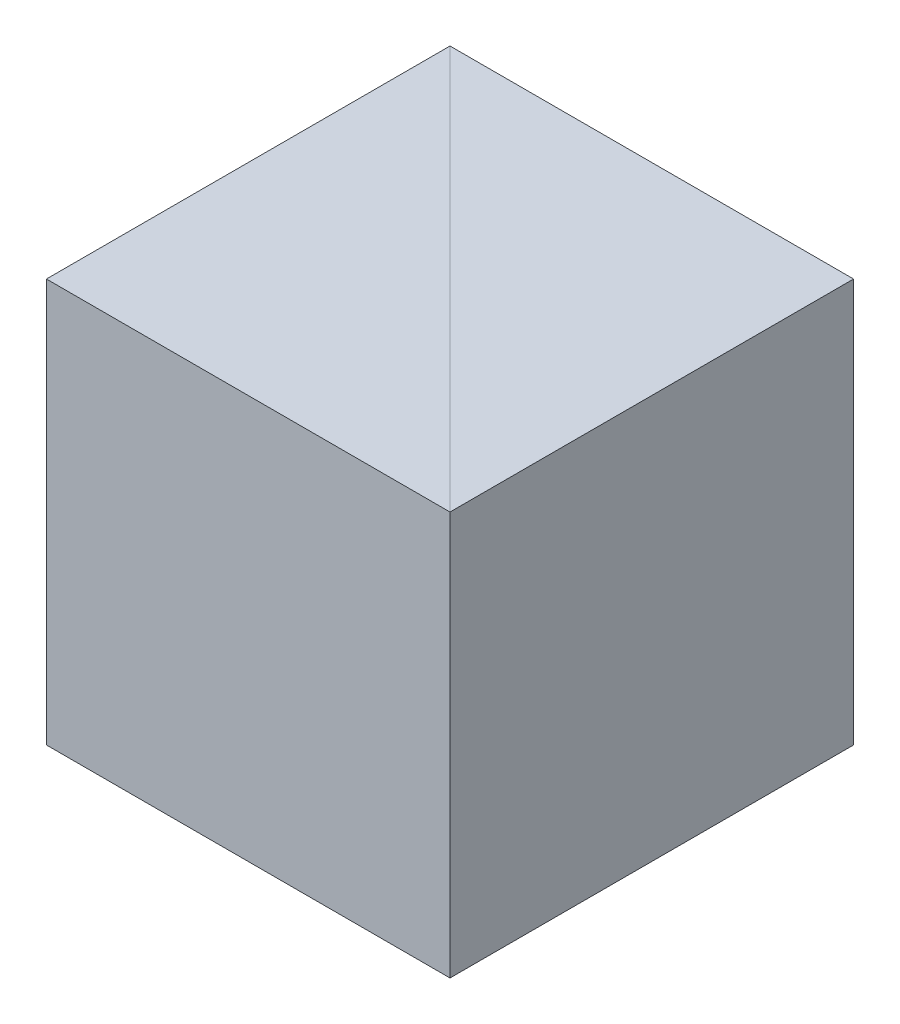
ISO-10303-21;
HEADER;
FILE_DESCRIPTION(('STEP AP214'),'2;1');
FILE_NAME('part.step','',(''),(''),'','','');
FILE_SCHEMA(('AUTOMOTIVE_DESIGN { 1 0 10303 214 1 1 1 1 }'));
ENDSEC;
DATA;
#1=APPLICATION_CONTEXT('core data for automotive mechanical design processes');
#2=APPLICATION_PROTOCOL_DEFINITION('international standard','automotive_design',2000,#1);
#3=PRODUCT_CONTEXT('',#1,'mechanical');
#4=PRODUCT('Part','Part','',(#3));
#5=PRODUCT_RELATED_PRODUCT_CATEGORY('part','',(#4));
#6=PRODUCT_DEFINITION_FORMATION('','',#4);
#7=PRODUCT_DEFINITION_CONTEXT('part definition',#1,'design');
#8=PRODUCT_DEFINITION('design','',#6,#7);
#9=PRODUCT_DEFINITION_SHAPE('','',#8);
#10=(LENGTH_UNIT() NAMED_UNIT(*) SI_UNIT(.MILLI.,.METRE.));
#11=(NAMED_UNIT(*) PLANE_ANGLE_UNIT() SI_UNIT($,.RADIAN.));
#12=(NAMED_UNIT(*) SI_UNIT($,.STERADIAN.) SOLID_ANGLE_UNIT());
#13=UNCERTAINTY_MEASURE_WITH_UNIT(LENGTH_MEASURE(1.E-05),#10,'distance_accuracy_value','');
#14=(GEOMETRIC_REPRESENTATION_CONTEXT(3) GLOBAL_UNCERTAINTY_ASSIGNED_CONTEXT((#13)) GLOBAL_UNIT_ASSIGNED_CONTEXT((#10,
#11,#12)) REPRESENTATION_CONTEXT('',''));
#15=CARTESIAN_POINT('',(0.,0.,0.));
#16=DIRECTION('',(0.,0.,1.));
#17=DIRECTION('',(1.,0.,0.));
#18=AXIS2_PLACEMENT_3D('',#15,#16,#17);
#19=CARTESIAN_POINT('',(0.,12.7,0.));
#20=DIRECTION('',(0.707106781186547,0.,-0.707106781186548));
#21=DIRECTION('',(-0.707106781186548,0.,-0.707106781186547));
#22=AXIS2_PLACEMENT_3D('',#19,#20,#21);
#23=PLANE('',#22);
#24=DIRECTION('',(0.707106781186548,0.,0.707106781186547));
#25=VECTOR('',#24,1.);
#26=CARTESIAN_POINT('',(0.,0.,0.));
#27=LINE('',#26,#25);
#28=CARTESIAN_POINT('',(-12.7,0.,-12.7));
#29=VERTEX_POINT('',#28);
#30=CARTESIAN_POINT('',(0.,0.,0.));
#31=VERTEX_POINT('',#30);
#32=EDGE_CURVE('E97',#29,#31,#27,.T.);
#33=ORIENTED_EDGE('',*,*,#32,.F.);
#34=DIRECTION('',(0.,-1.,0.));
#35=VECTOR('',#34,1.);
#36=CARTESIAN_POINT('',(-12.7,12.7,-12.7));
#37=LINE('',#36,#35);
#38=CARTESIAN_POINT('',(-12.7,12.7,-12.7));
#39=VERTEX_POINT('',#38);
#40=EDGE_CURVE('E12',#39,#29,#37,.T.);
#41=ORIENTED_EDGE('',*,*,#40,.F.);
#42=DIRECTION('',(0.707106781186548,0.,0.707106781186547));
#43=VECTOR('',#42,1.);
#44=CARTESIAN_POINT('',(0.,12.7,0.));
#45=LINE('',#44,#43);
#46=CARTESIAN_POINT('',(0.,12.7,0.));
#47=VERTEX_POINT('',#46);
#48=EDGE_CURVE('E89',#39,#47,#45,.T.);
#49=ORIENTED_EDGE('',*,*,#48,.T.);
#50=DIRECTION('',(0.,-1.,0.));
#51=VECTOR('',#50,1.);
#52=CARTESIAN_POINT('',(0.,12.7,0.));
#53=LINE('',#52,#51);
#54=EDGE_CURVE('E48',#47,#31,#53,.T.);
#55=ORIENTED_EDGE('',*,*,#54,.T.);
#56=EDGE_LOOP('',(#33,#41,#49,#55));
#57=FACE_BOUND('',#56,.T.);
#58=ADVANCED_FACE('F45',(#57),#23,.T.);
#59=CARTESIAN_POINT('',(-12.7,12.7,-12.7));
#60=DIRECTION('',(-1.,0.,0.));
#61=DIRECTION('',(0.,0.,1.));
#62=AXIS2_PLACEMENT_3D('',#59,#60,#61);
#63=PLANE('',#62);
#64=DIRECTION('',(0.,0.,-1.));
#65=VECTOR('',#64,1.);
#66=CARTESIAN_POINT('',(-12.7,0.,-12.7));
#67=LINE('',#66,#65);
#68=CARTESIAN_POINT('',(-12.7,0.,0.));
#69=VERTEX_POINT('',#68);
#70=EDGE_CURVE('E91',#69,#29,#67,.T.);
#71=ORIENTED_EDGE('',*,*,#70,.F.);
#72=DIRECTION('',(0.,-1.,0.));
#73=VECTOR('',#72,1.);
#74=CARTESIAN_POINT('',(-12.7,12.7,0.));
#75=LINE('',#74,#73);
#76=CARTESIAN_POINT('',(-12.7,12.7,0.));
#77=VERTEX_POINT('',#76);
#78=EDGE_CURVE('E54',#77,#69,#75,.T.);
#79=ORIENTED_EDGE('',*,*,#78,.F.);
#80=DIRECTION('',(0.,0.,-1.));
#81=VECTOR('',#80,1.);
#82=CARTESIAN_POINT('',(-12.7,12.7,-12.7));
#83=LINE('',#82,#81);
#84=EDGE_CURVE('E86',#77,#39,#83,.T.);
#85=ORIENTED_EDGE('',*,*,#84,.T.);
#86=ORIENTED_EDGE('',*,*,#40,.T.);
#87=EDGE_LOOP('',(#71,#79,#85,#86));
#88=FACE_BOUND('',#87,.T.);
#89=ADVANCED_FACE('F101',(#88),#63,.T.);
#90=CARTESIAN_POINT('',(-12.7,12.7,0.));
#91=DIRECTION('',(0.,0.,1.));
#92=DIRECTION('',(1.,0.,0.));
#93=AXIS2_PLACEMENT_3D('',#90,#91,#92);
#94=PLANE('',#93);
#95=DIRECTION('',(-1.,0.,0.));
#96=VECTOR('',#95,1.);
#97=CARTESIAN_POINT('',(-12.7,0.,0.));
#98=LINE('',#97,#96);
#99=EDGE_CURVE('E84',#31,#69,#98,.T.);
#100=ORIENTED_EDGE('',*,*,#99,.F.);
#101=ORIENTED_EDGE('',*,*,#54,.F.);
#102=DIRECTION('',(-1.,0.,0.));
#103=VECTOR('',#102,1.);
#104=CARTESIAN_POINT('',(-12.7,12.7,0.));
#105=LINE('',#104,#103);
#106=EDGE_CURVE('E82',#47,#77,#105,.T.);
#107=ORIENTED_EDGE('',*,*,#106,.T.);
#108=ORIENTED_EDGE('',*,*,#78,.T.);
#109=EDGE_LOOP('',(#100,#101,#107,#108));
#110=FACE_BOUND('',#109,.T.);
#111=ADVANCED_FACE('F81',(#110),#94,.T.);
#112=CARTESIAN_POINT('',(0.,12.7,0.));
#113=DIRECTION('',(0.,1.,0.));
#114=DIRECTION('',(0.,0.,1.));
#115=AXIS2_PLACEMENT_3D('',#112,#113,#114);
#116=PLANE('',#115);
#117=ORIENTED_EDGE('',*,*,#48,.F.);
#118=ORIENTED_EDGE('',*,*,#84,.F.);
#119=ORIENTED_EDGE('',*,*,#106,.F.);
#120=EDGE_LOOP('',(#117,#118,#119));
#121=FACE_BOUND('',#120,.T.);
#122=ADVANCED_FACE('F88',(#121),#116,.T.);
#123=CARTESIAN_POINT('',(0.,0.,0.));
#124=DIRECTION('',(0.,1.,0.));
#125=DIRECTION('',(0.,0.,1.));
#126=AXIS2_PLACEMENT_3D('',#123,#124,#125);
#127=PLANE('',#126);
#128=ORIENTED_EDGE('',*,*,#32,.T.);
#129=ORIENTED_EDGE('',*,*,#99,.T.);
#130=ORIENTED_EDGE('',*,*,#70,.T.);
#131=EDGE_LOOP('',(#128,#129,#130));
#132=FACE_BOUND('',#131,.T.);
#133=ADVANCED_FACE('F100',(#132),#127,.F.);
#134=CLOSED_SHELL('',(#58,#89,#111,#122,#133));
#135=MANIFOLD_SOLID_BREP('B2',#134);
#136=CARTESIAN_POINT('',(-12.7,12.7,-12.7));
#137=DIRECTION('',(0.707106781186547,0.,-0.707106781186548));
#138=DIRECTION('',(-0.707106781186548,0.,-0.707106781186547));
#139=AXIS2_PLACEMENT_3D('',#136,#137,#138);
#140=PLANE('',#139);
#141=DIRECTION('',(0.707106781186548,0.,0.707106781186547));
#142=VECTOR('',#141,1.);
#143=CARTESIAN_POINT('',(-12.7,0.,-12.7));
#144=LINE('',#143,#142);
#145=CARTESIAN_POINT('',(-12.7,0.,-12.7));
#146=VERTEX_POINT('',#145);
#147=CARTESIAN_POINT('',(0.,0.,0.));
#148=VERTEX_POINT('',#147);
#149=EDGE_CURVE('E190',#146,#148,#144,.T.);
#150=ORIENTED_EDGE('',*,*,#149,.T.);
#151=DIRECTION('',(0.,-1.,0.));
#152=VECTOR('',#151,1.);
#153=CARTESIAN_POINT('',(0.,12.7,0.));
#154=LINE('',#153,#152);
#155=CARTESIAN_POINT('',(0.,12.7,0.));
#156=VERTEX_POINT('',#155);
#157=EDGE_CURVE('E43',#156,#148,#154,.T.);
#158=ORIENTED_EDGE('',*,*,#157,.F.);
#159=DIRECTION('',(0.707106781186548,0.,0.707106781186547));
#160=VECTOR('',#159,1.);
#161=CARTESIAN_POINT('',(-12.7,12.7,-12.7));
#162=LINE('',#161,#160);
#163=CARTESIAN_POINT('',(-12.7,12.7,-12.7));
#164=VERTEX_POINT('',#163);
#165=EDGE_CURVE('E183',#164,#156,#162,.T.);
#166=ORIENTED_EDGE('',*,*,#165,.F.);
#167=DIRECTION('',(0.,-1.,0.));
#168=VECTOR('',#167,1.);
#169=CARTESIAN_POINT('',(-12.7,12.7,-12.7));
#170=LINE('',#169,#168);
#171=EDGE_CURVE('E191',#164,#146,#170,.T.);
#172=ORIENTED_EDGE('',*,*,#171,.T.);
#173=EDGE_LOOP('',(#150,#158,#166,#172));
#174=FACE_BOUND('',#173,.T.);
#175=ADVANCED_FACE('F143',(#174),#140,.F.);
#176=CARTESIAN_POINT('',(0.,12.7,0.));
#177=DIRECTION('',(-1.,0.,0.));
#178=DIRECTION('',(0.,0.,1.));
#179=AXIS2_PLACEMENT_3D('',#176,#177,#178);
#180=PLANE('',#179);
#181=DIRECTION('',(0.,0.,-1.));
#182=VECTOR('',#181,1.);
#183=CARTESIAN_POINT('',(0.,0.,0.));
#184=LINE('',#183,#182);
#185=CARTESIAN_POINT('',(0.,0.,-12.7));
#186=VERTEX_POINT('',#185);
#187=EDGE_CURVE('E171',#148,#186,#184,.T.);
#188=ORIENTED_EDGE('',*,*,#187,.T.);
#189=DIRECTION('',(0.,-1.,0.));
#190=VECTOR('',#189,1.);
#191=CARTESIAN_POINT('',(0.,12.7,-12.7));
#192=LINE('',#191,#190);
#193=CARTESIAN_POINT('',(0.,12.7,-12.7));
#194=VERTEX_POINT('',#193);
#195=EDGE_CURVE('E151',#194,#186,#192,.T.);
#196=ORIENTED_EDGE('',*,*,#195,.F.);
#197=DIRECTION('',(0.,0.,-1.));
#198=VECTOR('',#197,1.);
#199=CARTESIAN_POINT('',(0.,12.7,0.));
#200=LINE('',#199,#198);
#201=EDGE_CURVE('E179',#156,#194,#200,.T.);
#202=ORIENTED_EDGE('',*,*,#201,.F.);
#203=ORIENTED_EDGE('',*,*,#157,.T.);
#204=EDGE_LOOP('',(#188,#196,#202,#203));
#205=FACE_BOUND('',#204,.T.);
#206=ADVANCED_FACE('F180',(#205),#180,.F.);
#207=CARTESIAN_POINT('',(0.,12.7,-12.7));
#208=DIRECTION('',(0.,0.,1.));
#209=DIRECTION('',(1.,0.,0.));
#210=AXIS2_PLACEMENT_3D('',#207,#208,#209);
#211=PLANE('',#210);
#212=DIRECTION('',(-1.,0.,0.));
#213=VECTOR('',#212,1.);
#214=CARTESIAN_POINT('',(0.,0.,-12.7));
#215=LINE('',#214,#213);
#216=EDGE_CURVE('E176',#186,#146,#215,.T.);
#217=ORIENTED_EDGE('',*,*,#216,.T.);
#218=ORIENTED_EDGE('',*,*,#171,.F.);
#219=DIRECTION('',(-1.,0.,0.));
#220=VECTOR('',#219,1.);
#221=CARTESIAN_POINT('',(0.,12.7,-12.7));
#222=LINE('',#221,#220);
#223=EDGE_CURVE('E159',#194,#164,#222,.T.);
#224=ORIENTED_EDGE('',*,*,#223,.F.);
#225=ORIENTED_EDGE('',*,*,#195,.T.);
#226=EDGE_LOOP('',(#217,#218,#224,#225));
#227=FACE_BOUND('',#226,.T.);
#228=ADVANCED_FACE('F198',(#227),#211,.F.);
#229=CARTESIAN_POINT('',(0.,12.7,0.));
#230=DIRECTION('',(0.,1.,0.));
#231=DIRECTION('',(0.,0.,1.));
#232=AXIS2_PLACEMENT_3D('',#229,#230,#231);
#233=PLANE('',#232);
#234=ORIENTED_EDGE('',*,*,#165,.T.);
#235=ORIENTED_EDGE('',*,*,#201,.T.);
#236=ORIENTED_EDGE('',*,*,#223,.T.);
#237=EDGE_LOOP('',(#234,#235,#236));
#238=FACE_BOUND('',#237,.T.);
#239=ADVANCED_FACE('F186',(#238),#233,.T.);
#240=CARTESIAN_POINT('',(0.,0.,0.));
#241=DIRECTION('',(0.,1.,0.));
#242=DIRECTION('',(0.,0.,1.));
#243=AXIS2_PLACEMENT_3D('',#240,#241,#242);
#244=PLANE('',#243);
#245=ORIENTED_EDGE('',*,*,#149,.F.);
#246=ORIENTED_EDGE('',*,*,#216,.F.);
#247=ORIENTED_EDGE('',*,*,#187,.F.);
#248=EDGE_LOOP('',(#245,#246,#247));
#249=FACE_BOUND('',#248,.T.);
#250=ADVANCED_FACE('F199',(#249),#244,.F.);
#251=CLOSED_SHELL('',(#175,#206,#228,#239,#250));
#252=MANIFOLD_SOLID_BREP('B6',#251);
#253=ADVANCED_BREP_SHAPE_REPRESENTATION('',(#18,#135,#252),#14);
#254=SHAPE_DEFINITION_REPRESENTATION(#9,#253);
ENDSEC;
END-ISO-10303-21;
